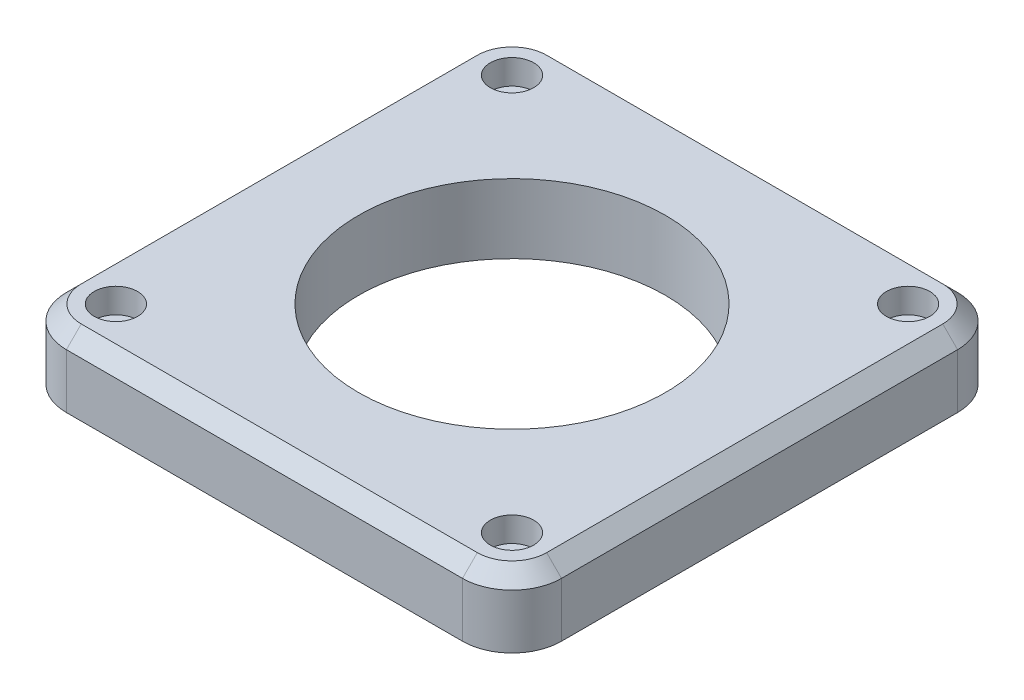
ISO-10303-21;
HEADER;
FILE_DESCRIPTION(('STEP AP214'),'2;1');
FILE_NAME('part.step','',(''),(''),'','','');
FILE_SCHEMA(('AUTOMOTIVE_DESIGN { 1 0 10303 214 1 1 1 1 }'));
ENDSEC;
DATA;
#1=APPLICATION_CONTEXT('core data for automotive mechanical design processes');
#2=APPLICATION_PROTOCOL_DEFINITION('international standard','automotive_design',2000,#1);
#3=PRODUCT_CONTEXT('',#1,'mechanical');
#4=PRODUCT('Part','Part','',(#3));
#5=PRODUCT_RELATED_PRODUCT_CATEGORY('part','',(#4));
#6=PRODUCT_DEFINITION_FORMATION('','',#4);
#7=PRODUCT_DEFINITION_CONTEXT('part definition',#1,'design');
#8=PRODUCT_DEFINITION('design','',#6,#7);
#9=PRODUCT_DEFINITION_SHAPE('','',#8);
#10=(LENGTH_UNIT() NAMED_UNIT(*) SI_UNIT(.MILLI.,.METRE.));
#11=(NAMED_UNIT(*) PLANE_ANGLE_UNIT() SI_UNIT($,.RADIAN.));
#12=(NAMED_UNIT(*) SI_UNIT($,.STERADIAN.) SOLID_ANGLE_UNIT());
#13=UNCERTAINTY_MEASURE_WITH_UNIT(LENGTH_MEASURE(1.E-05),#10,'distance_accuracy_value','');
#14=(GEOMETRIC_REPRESENTATION_CONTEXT(3) GLOBAL_UNCERTAINTY_ASSIGNED_CONTEXT((#13)) GLOBAL_UNIT_ASSIGNED_CONTEXT((#10,
#11,#12)) REPRESENTATION_CONTEXT('',''));
#15=CARTESIAN_POINT('',(0.,0.,0.));
#16=DIRECTION('',(0.,0.,1.));
#17=DIRECTION('',(1.,0.,0.));
#18=AXIS2_PLACEMENT_3D('',#15,#16,#17);
#19=CARTESIAN_POINT('',(-40.,14.,47.));
#20=DIRECTION('',(0.,-0.707106781186548,-0.707106781186547));
#21=DIRECTION('',(1.,0.,0.));
#22=AXIS2_PLACEMENT_3D('',#19,#20,#21);
#23=PLANE('',#22);
#24=DIRECTION('',(0.,-0.707106781186547,0.707106781186548));
#25=VECTOR('',#24,1.);
#26=CARTESIAN_POINT('',(39.9999999999999,14.,47.));
#27=LINE('',#26,#25);
#28=CARTESIAN_POINT('',(39.9999999999999,14.,47.));
#29=VERTEX_POINT('',#28);
#30=CARTESIAN_POINT('',(39.9999999999999,11.,50.));
#31=VERTEX_POINT('',#30);
#32=EDGE_CURVE('E13',#29,#31,#27,.T.);
#33=ORIENTED_EDGE('',*,*,#32,.F.);
#34=DIRECTION('',(1.,0.,0.));
#35=VECTOR('',#34,1.);
#36=CARTESIAN_POINT('',(-40.,14.,47.));
#37=LINE('',#36,#35);
#38=CARTESIAN_POINT('',(-39.9999999999999,14.,47.));
#39=VERTEX_POINT('',#38);
#40=EDGE_CURVE('E137',#39,#29,#37,.T.);
#41=ORIENTED_EDGE('',*,*,#40,.F.);
#42=DIRECTION('',(0.,-0.707106781186547,0.707106781186548));
#43=VECTOR('',#42,1.);
#44=CARTESIAN_POINT('',(-39.9999999999999,14.,47.));
#45=LINE('',#44,#43);
#46=CARTESIAN_POINT('',(-39.9999999999999,11.,50.));
#47=VERTEX_POINT('',#46);
#48=EDGE_CURVE('E47',#39,#47,#45,.T.);
#49=ORIENTED_EDGE('',*,*,#48,.T.);
#50=DIRECTION('',(-1.,0.,0.));
#51=VECTOR('',#50,1.);
#52=CARTESIAN_POINT('',(-39.9999999999999,11.,50.));
#53=LINE('',#52,#51);
#54=EDGE_CURVE('E134',#31,#47,#53,.T.);
#55=ORIENTED_EDGE('',*,*,#54,.F.);
#56=EDGE_LOOP('',(#33,#41,#49,#55));
#57=FACE_BOUND('',#56,.T.);
#58=ADVANCED_FACE('F39',(#57),#23,.F.);
#59=CARTESIAN_POINT('',(-40.,14.,40.));
#60=DIRECTION('',(0.,-1.,0.));
#61=DIRECTION('',(0.,0.,-1.));
#62=AXIS2_PLACEMENT_3D('',#59,#60,#61);
#63=CONICAL_SURFACE('',#62,7.,0.785398163397449);
#64=ORIENTED_EDGE('',*,*,#48,.F.);
#65=CARTESIAN_POINT('',(-40.,14.,40.));
#66=DIRECTION('',(0.,-1.,0.));
#67=DIRECTION('',(0.,0.,-1.));
#68=AXIS2_PLACEMENT_3D('',#65,#66,#67);
#69=CIRCLE('',#68,7.);
#70=CARTESIAN_POINT('',(-47.,14.,40.));
#71=VERTEX_POINT('',#70);
#72=EDGE_CURVE('E204',#71,#39,#69,.F.);
#73=ORIENTED_EDGE('',*,*,#72,.F.);
#74=DIRECTION('',(-0.707106781186548,-0.707106781186547,0.));
#75=VECTOR('',#74,1.);
#76=CARTESIAN_POINT('',(-47.,14.,39.9999999999999));
#77=LINE('',#76,#75);
#78=CARTESIAN_POINT('',(-50.,11.,39.9999999999999));
#79=VERTEX_POINT('',#78);
#80=EDGE_CURVE('E61',#71,#79,#77,.T.);
#81=ORIENTED_EDGE('',*,*,#80,.T.);
#82=CARTESIAN_POINT('',(-40.,11.,40.));
#83=DIRECTION('',(0.,-1.,0.));
#84=DIRECTION('',(0.,0.,-1.));
#85=AXIS2_PLACEMENT_3D('',#82,#83,#84);
#86=CIRCLE('',#85,10.);
#87=EDGE_CURVE('E243',#47,#79,#86,.T.);
#88=ORIENTED_EDGE('',*,*,#87,.F.);
#89=EDGE_LOOP('',(#64,#73,#81,#88));
#90=FACE_BOUND('',#89,.T.);
#91=ADVANCED_FACE('F292',(#90),#63,.T.);
#92=CARTESIAN_POINT('',(-47.,14.,40.));
#93=DIRECTION('',(0.707106781186547,-0.707106781186548,0.));
#94=DIRECTION('',(0.,0.,1.));
#95=AXIS2_PLACEMENT_3D('',#92,#93,#94);
#96=PLANE('',#95);
#97=ORIENTED_EDGE('',*,*,#80,.F.);
#98=DIRECTION('',(0.,0.,1.));
#99=VECTOR('',#98,1.);
#100=CARTESIAN_POINT('',(-47.,14.,40.));
#101=LINE('',#100,#99);
#102=CARTESIAN_POINT('',(-47.,14.,-39.9999999999999));
#103=VERTEX_POINT('',#102);
#104=EDGE_CURVE('E207',#103,#71,#101,.T.);
#105=ORIENTED_EDGE('',*,*,#104,.F.);
#106=DIRECTION('',(-0.707106781186548,-0.707106781186547,0.));
#107=VECTOR('',#106,1.);
#108=CARTESIAN_POINT('',(-47.,14.,-40.));
#109=LINE('',#108,#107);
#110=CARTESIAN_POINT('',(-50.,11.,-39.9999999999999));
#111=VERTEX_POINT('',#110);
#112=EDGE_CURVE('E254',#103,#111,#109,.T.);
#113=ORIENTED_EDGE('',*,*,#112,.T.);
#114=DIRECTION('',(0.,0.,-1.));
#115=VECTOR('',#114,1.);
#116=CARTESIAN_POINT('',(-50.,11.,39.9999999999999));
#117=LINE('',#116,#115);
#118=EDGE_CURVE('E240',#79,#111,#117,.T.);
#119=ORIENTED_EDGE('',*,*,#118,.F.);
#120=EDGE_LOOP('',(#97,#105,#113,#119));
#121=FACE_BOUND('',#120,.T.);
#122=ADVANCED_FACE('F259',(#121),#96,.F.);
#123=CARTESIAN_POINT('',(-40.,14.,-40.));
#124=DIRECTION('',(0.,-1.,0.));
#125=DIRECTION('',(0.,0.,-1.));
#126=AXIS2_PLACEMENT_3D('',#123,#124,#125);
#127=CONICAL_SURFACE('',#126,6.99999999999999,0.785398163397449);
#128=ORIENTED_EDGE('',*,*,#112,.F.);
#129=CARTESIAN_POINT('',(-40.,14.,-40.));
#130=DIRECTION('',(0.,-1.,0.));
#131=DIRECTION('',(0.,0.,-1.));
#132=AXIS2_PLACEMENT_3D('',#129,#130,#131);
#133=CIRCLE('',#132,6.99999999999999);
#134=CARTESIAN_POINT('',(-39.9999999999999,14.,-47.));
#135=VERTEX_POINT('',#134);
#136=EDGE_CURVE('E210',#135,#103,#133,.F.);
#137=ORIENTED_EDGE('',*,*,#136,.F.);
#138=DIRECTION('',(0.,-0.707106781186546,-0.707106781186549));
#139=VECTOR('',#138,1.);
#140=CARTESIAN_POINT('',(-39.9999999999999,14.,-47.));
#141=LINE('',#140,#139);
#142=CARTESIAN_POINT('',(-39.9999999999999,11.,-50.));
#143=VERTEX_POINT('',#142);
#144=EDGE_CURVE('E252',#135,#143,#141,.T.);
#145=ORIENTED_EDGE('',*,*,#144,.T.);
#146=CARTESIAN_POINT('',(-40.,11.,-40.));
#147=DIRECTION('',(0.,-1.,0.));
#148=DIRECTION('',(0.,0.,-1.));
#149=AXIS2_PLACEMENT_3D('',#146,#147,#148);
#150=CIRCLE('',#149,10.);
#151=EDGE_CURVE('E237',#111,#143,#150,.T.);
#152=ORIENTED_EDGE('',*,*,#151,.F.);
#153=EDGE_LOOP('',(#128,#137,#145,#152));
#154=FACE_BOUND('',#153,.T.);
#155=ADVANCED_FACE('F266',(#154),#127,.T.);
#156=CARTESIAN_POINT('',(-40.,14.,-47.));
#157=DIRECTION('',(0.,-0.707106781186549,0.707106781186546));
#158=DIRECTION('',(-1.,0.,0.));
#159=AXIS2_PLACEMENT_3D('',#156,#157,#158);
#160=PLANE('',#159);
#161=ORIENTED_EDGE('',*,*,#144,.F.);
#162=DIRECTION('',(-1.,0.,0.));
#163=VECTOR('',#162,1.);
#164=CARTESIAN_POINT('',(-40.,14.,-47.));
#165=LINE('',#164,#163);
#166=CARTESIAN_POINT('',(39.9999999999999,14.,-47.));
#167=VERTEX_POINT('',#166);
#168=EDGE_CURVE('E213',#167,#135,#165,.T.);
#169=ORIENTED_EDGE('',*,*,#168,.F.);
#170=DIRECTION('',(0.,-0.707106781186547,-0.707106781186548));
#171=VECTOR('',#170,1.);
#172=CARTESIAN_POINT('',(39.9999999999999,14.,-47.));
#173=LINE('',#172,#171);
#174=CARTESIAN_POINT('',(39.9999999999999,11.,-50.));
#175=VERTEX_POINT('',#174);
#176=EDGE_CURVE('E250',#167,#175,#173,.T.);
#177=ORIENTED_EDGE('',*,*,#176,.T.);
#178=DIRECTION('',(1.,0.,0.));
#179=VECTOR('',#178,1.);
#180=CARTESIAN_POINT('',(-39.9999999999999,11.,-50.));
#181=LINE('',#180,#179);
#182=EDGE_CURVE('E234',#143,#175,#181,.T.);
#183=ORIENTED_EDGE('',*,*,#182,.F.);
#184=EDGE_LOOP('',(#161,#169,#177,#183));
#185=FACE_BOUND('',#184,.T.);
#186=ADVANCED_FACE('F314',(#185),#160,.F.);
#187=CARTESIAN_POINT('',(40.,14.,-40.));
#188=DIRECTION('',(0.,-1.,0.));
#189=DIRECTION('',(0.,0.,-1.));
#190=AXIS2_PLACEMENT_3D('',#187,#188,#189);
#191=CONICAL_SURFACE('',#190,7.,0.785398163397449);
#192=ORIENTED_EDGE('',*,*,#176,.F.);
#193=CARTESIAN_POINT('',(40.,14.,-40.));
#194=DIRECTION('',(0.,-1.,0.));
#195=DIRECTION('',(0.,0.,-1.));
#196=AXIS2_PLACEMENT_3D('',#193,#194,#195);
#197=CIRCLE('',#196,7.);
#198=CARTESIAN_POINT('',(47.,14.,-40.));
#199=VERTEX_POINT('',#198);
#200=EDGE_CURVE('E216',#199,#167,#197,.F.);
#201=ORIENTED_EDGE('',*,*,#200,.F.);
#202=DIRECTION('',(0.707106781186547,-0.707106781186548,0.));
#203=VECTOR('',#202,1.);
#204=CARTESIAN_POINT('',(47.,14.,-39.9999999999999));
#205=LINE('',#204,#203);
#206=CARTESIAN_POINT('',(50.,11.,-39.9999999999999));
#207=VERTEX_POINT('',#206);
#208=EDGE_CURVE('E248',#199,#207,#205,.T.);
#209=ORIENTED_EDGE('',*,*,#208,.T.);
#210=CARTESIAN_POINT('',(40.,11.,-40.));
#211=DIRECTION('',(0.,-1.,0.));
#212=DIRECTION('',(0.,0.,-1.));
#213=AXIS2_PLACEMENT_3D('',#210,#211,#212);
#214=CIRCLE('',#213,10.);
#215=EDGE_CURVE('E231',#175,#207,#214,.T.);
#216=ORIENTED_EDGE('',*,*,#215,.F.);
#217=EDGE_LOOP('',(#192,#201,#209,#216));
#218=FACE_BOUND('',#217,.T.);
#219=ADVANCED_FACE('F320',(#218),#191,.T.);
#220=CARTESIAN_POINT('',(47.,14.,40.));
#221=DIRECTION('',(-0.707106781186548,-0.707106781186547,0.));
#222=DIRECTION('',(0.,0.,-1.));
#223=AXIS2_PLACEMENT_3D('',#220,#221,#222);
#224=PLANE('',#223);
#225=ORIENTED_EDGE('',*,*,#208,.F.);
#226=DIRECTION('',(0.,0.,-1.));
#227=VECTOR('',#226,1.);
#228=CARTESIAN_POINT('',(47.,14.,40.));
#229=LINE('',#228,#227);
#230=CARTESIAN_POINT('',(47.,14.,39.9999999999999));
#231=VERTEX_POINT('',#230);
#232=EDGE_CURVE('E219',#231,#199,#229,.T.);
#233=ORIENTED_EDGE('',*,*,#232,.F.);
#234=DIRECTION('',(0.707106781186548,-0.707106781186547,0.));
#235=VECTOR('',#234,1.);
#236=CARTESIAN_POINT('',(47.,14.,40.));
#237=LINE('',#236,#235);
#238=CARTESIAN_POINT('',(50.,11.,39.9999999999999));
#239=VERTEX_POINT('',#238);
#240=EDGE_CURVE('E246',#231,#239,#237,.T.);
#241=ORIENTED_EDGE('',*,*,#240,.T.);
#242=DIRECTION('',(0.,0.,1.));
#243=VECTOR('',#242,1.);
#244=CARTESIAN_POINT('',(50.,11.,39.9999999999999));
#245=LINE('',#244,#243);
#246=EDGE_CURVE('E228',#207,#239,#245,.T.);
#247=ORIENTED_EDGE('',*,*,#246,.F.);
#248=EDGE_LOOP('',(#225,#233,#241,#247));
#249=FACE_BOUND('',#248,.T.);
#250=ADVANCED_FACE('F327',(#249),#224,.F.);
#251=CARTESIAN_POINT('',(40.,14.,40.));
#252=DIRECTION('',(0.,-1.,0.));
#253=DIRECTION('',(0.,0.,-1.));
#254=AXIS2_PLACEMENT_3D('',#251,#252,#253);
#255=CONICAL_SURFACE('',#254,6.99999999999999,0.785398163397449);
#256=CARTESIAN_POINT('',(40.,14.,40.));
#257=DIRECTION('',(0.,-1.,0.));
#258=DIRECTION('',(0.,0.,-1.));
#259=AXIS2_PLACEMENT_3D('',#256,#257,#258);
#260=CIRCLE('',#259,6.99999999999999);
#261=EDGE_CURVE('E222',#29,#231,#260,.F.);
#262=ORIENTED_EDGE('',*,*,#261,.F.);
#263=ORIENTED_EDGE('',*,*,#32,.T.);
#264=CARTESIAN_POINT('',(40.,11.,40.));
#265=DIRECTION('',(0.,-1.,0.));
#266=DIRECTION('',(0.,0.,-1.));
#267=AXIS2_PLACEMENT_3D('',#264,#265,#266);
#268=CIRCLE('',#267,10.);
#269=EDGE_CURVE('E225',#239,#31,#268,.T.);
#270=ORIENTED_EDGE('',*,*,#269,.F.);
#271=ORIENTED_EDGE('',*,*,#240,.F.);
#272=EDGE_LOOP('',(#262,#263,#270,#271));
#273=FACE_BOUND('',#272,.T.);
#274=ADVANCED_FACE('F290',(#273),#255,.T.);
#275=CARTESIAN_POINT('',(-40.,14.,40.));
#276=DIRECTION('',(0.,-1.,0.));
#277=DIRECTION('',(0.,0.,-1.));
#278=AXIS2_PLACEMENT_3D('',#275,#276,#277);
#279=CYLINDRICAL_SURFACE('',#278,2.625);
#280=CARTESIAN_POINT('',(-40.,0.,40.));
#281=DIRECTION('',(0.,1.,0.));
#282=DIRECTION('',(0.,0.,1.));
#283=AXIS2_PLACEMENT_3D('',#280,#281,#282);
#284=CIRCLE('',#283,2.625);
#285=CARTESIAN_POINT('',(-40.,0.,42.625));
#286=VERTEX_POINT('',#285);
#287=EDGE_CURVE('E449',#286,#286,#284,.T.);
#288=ORIENTED_EDGE('',*,*,#287,.F.);
#289=EDGE_LOOP('',(#288));
#290=FACE_BOUND('',#289,.T.);
#291=CARTESIAN_POINT('',(-40.,9.,40.));
#292=DIRECTION('',(0.,1.,0.));
#293=DIRECTION('',(0.,0.,1.));
#294=AXIS2_PLACEMENT_3D('',#291,#292,#293);
#295=CIRCLE('',#294,2.625);
#296=CARTESIAN_POINT('',(-40.,9.,42.625));
#297=VERTEX_POINT('',#296);
#298=EDGE_CURVE('E198',#297,#297,#295,.T.);
#299=ORIENTED_EDGE('',*,*,#298,.T.);
#300=EDGE_LOOP('',(#299));
#301=FACE_BOUND('',#300,.T.);
#302=ADVANCED_FACE('F339',(#290,#301),#279,.F.);
#303=CARTESIAN_POINT('',(40.,14.,40.));
#304=DIRECTION('',(0.,-1.,0.));
#305=DIRECTION('',(0.,0.,-1.));
#306=AXIS2_PLACEMENT_3D('',#303,#304,#305);
#307=CYLINDRICAL_SURFACE('',#306,2.625);
#308=CARTESIAN_POINT('',(40.,0.,40.));
#309=DIRECTION('',(0.,1.,0.));
#310=DIRECTION('',(0.,0.,1.));
#311=AXIS2_PLACEMENT_3D('',#308,#309,#310);
#312=CIRCLE('',#311,2.625);
#313=CARTESIAN_POINT('',(40.,0.,42.625));
#314=VERTEX_POINT('',#313);
#315=EDGE_CURVE('E446',#314,#314,#312,.T.);
#316=ORIENTED_EDGE('',*,*,#315,.F.);
#317=EDGE_LOOP('',(#316));
#318=FACE_BOUND('',#317,.T.);
#319=CARTESIAN_POINT('',(40.,9.,40.));
#320=DIRECTION('',(0.,1.,0.));
#321=DIRECTION('',(0.,0.,1.));
#322=AXIS2_PLACEMENT_3D('',#319,#320,#321);
#323=CIRCLE('',#322,2.625);
#324=CARTESIAN_POINT('',(40.,9.,42.625));
#325=VERTEX_POINT('',#324);
#326=EDGE_CURVE('E195',#325,#325,#323,.T.);
#327=ORIENTED_EDGE('',*,*,#326,.T.);
#328=EDGE_LOOP('',(#327));
#329=FACE_BOUND('',#328,.T.);
#330=ADVANCED_FACE('F371',(#318,#329),#307,.F.);
#331=CARTESIAN_POINT('',(40.,14.,-40.));
#332=DIRECTION('',(0.,-1.,0.));
#333=DIRECTION('',(0.,0.,-1.));
#334=AXIS2_PLACEMENT_3D('',#331,#332,#333);
#335=CYLINDRICAL_SURFACE('',#334,2.625);
#336=CARTESIAN_POINT('',(40.,0.,-40.));
#337=DIRECTION('',(0.,1.,0.));
#338=DIRECTION('',(0.,0.,1.));
#339=AXIS2_PLACEMENT_3D('',#336,#337,#338);
#340=CIRCLE('',#339,2.625);
#341=CARTESIAN_POINT('',(40.,0.,-37.375));
#342=VERTEX_POINT('',#341);
#343=EDGE_CURVE('E443',#342,#342,#340,.T.);
#344=ORIENTED_EDGE('',*,*,#343,.F.);
#345=EDGE_LOOP('',(#344));
#346=FACE_BOUND('',#345,.T.);
#347=CARTESIAN_POINT('',(40.,9.,-40.));
#348=DIRECTION('',(0.,1.,0.));
#349=DIRECTION('',(0.,0.,1.));
#350=AXIS2_PLACEMENT_3D('',#347,#348,#349);
#351=CIRCLE('',#350,2.625);
#352=CARTESIAN_POINT('',(40.,9.,-37.375));
#353=VERTEX_POINT('',#352);
#354=EDGE_CURVE('E191',#353,#353,#351,.T.);
#355=ORIENTED_EDGE('',*,*,#354,.T.);
#356=EDGE_LOOP('',(#355));
#357=FACE_BOUND('',#356,.T.);
#358=ADVANCED_FACE('F375',(#346,#357),#335,.F.);
#359=CARTESIAN_POINT('',(-40.,14.,-40.));
#360=DIRECTION('',(0.,-1.,0.));
#361=DIRECTION('',(0.,0.,-1.));
#362=AXIS2_PLACEMENT_3D('',#359,#360,#361);
#363=CYLINDRICAL_SURFACE('',#362,2.625);
#364=CARTESIAN_POINT('',(-40.,0.,-40.));
#365=DIRECTION('',(0.,1.,0.));
#366=DIRECTION('',(0.,0.,1.));
#367=AXIS2_PLACEMENT_3D('',#364,#365,#366);
#368=CIRCLE('',#367,2.625);
#369=CARTESIAN_POINT('',(-40.,0.,-37.375));
#370=VERTEX_POINT('',#369);
#371=EDGE_CURVE('E201',#370,#370,#368,.T.);
#372=ORIENTED_EDGE('',*,*,#371,.F.);
#373=EDGE_LOOP('',(#372));
#374=FACE_BOUND('',#373,.T.);
#375=CARTESIAN_POINT('',(-40.,9.,-40.));
#376=DIRECTION('',(0.,1.,0.));
#377=DIRECTION('',(0.,0.,1.));
#378=AXIS2_PLACEMENT_3D('',#375,#376,#377);
#379=CIRCLE('',#378,2.625);
#380=CARTESIAN_POINT('',(-40.,9.,-37.375));
#381=VERTEX_POINT('',#380);
#382=EDGE_CURVE('E188',#381,#381,#379,.T.);
#383=ORIENTED_EDGE('',*,*,#382,.T.);
#384=EDGE_LOOP('',(#383));
#385=FACE_BOUND('',#384,.T.);
#386=ADVANCED_FACE('F363',(#374,#385),#363,.F.);
#387=CARTESIAN_POINT('',(-40.,14.,40.));
#388=DIRECTION('',(0.,-1.,0.));
#389=DIRECTION('',(0.,0.,-1.));
#390=AXIS2_PLACEMENT_3D('',#387,#388,#389);
#391=PLANE('',#390);
#392=ORIENTED_EDGE('',*,*,#40,.T.);
#393=ORIENTED_EDGE('',*,*,#261,.T.);
#394=ORIENTED_EDGE('',*,*,#232,.T.);
#395=ORIENTED_EDGE('',*,*,#200,.T.);
#396=ORIENTED_EDGE('',*,*,#168,.T.);
#397=ORIENTED_EDGE('',*,*,#136,.T.);
#398=ORIENTED_EDGE('',*,*,#104,.T.);
#399=ORIENTED_EDGE('',*,*,#72,.T.);
#400=EDGE_LOOP('',(#392,#393,#394,#395,#396,#397,#398,#399));
#401=FACE_BOUND('',#400,.T.);
#402=CARTESIAN_POINT('',(-40.,14.,40.));
#403=DIRECTION('',(0.,1.,0.));
#404=DIRECTION('',(0.,0.,1.));
#405=AXIS2_PLACEMENT_3D('',#402,#403,#404);
#406=CIRCLE('',#405,4.37500000000001);
#407=CARTESIAN_POINT('',(-40.,14.,44.375));
#408=VERTEX_POINT('',#407);
#409=EDGE_CURVE('E436',#408,#408,#406,.T.);
#410=ORIENTED_EDGE('',*,*,#409,.F.);
#411=EDGE_LOOP('',(#410));
#412=FACE_BOUND('',#411,.T.);
#413=CARTESIAN_POINT('',(40.,14.,40.));
#414=DIRECTION('',(0.,1.,0.));
#415=DIRECTION('',(0.,0.,1.));
#416=AXIS2_PLACEMENT_3D('',#413,#414,#415);
#417=CIRCLE('',#416,4.37500000000001);
#418=CARTESIAN_POINT('',(40.,14.,44.375));
#419=VERTEX_POINT('',#418);
#420=EDGE_CURVE('E430',#419,#419,#417,.T.);
#421=ORIENTED_EDGE('',*,*,#420,.F.);
#422=EDGE_LOOP('',(#421));
#423=FACE_BOUND('',#422,.T.);
#424=CARTESIAN_POINT('',(40.,14.,-40.));
#425=DIRECTION('',(0.,1.,0.));
#426=DIRECTION('',(0.,0.,1.));
#427=AXIS2_PLACEMENT_3D('',#424,#425,#426);
#428=CIRCLE('',#427,4.37500000000001);
#429=CARTESIAN_POINT('',(40.,14.,-35.625));
#430=VERTEX_POINT('',#429);
#431=EDGE_CURVE('E420',#430,#430,#428,.T.);
#432=ORIENTED_EDGE('',*,*,#431,.F.);
#433=EDGE_LOOP('',(#432));
#434=FACE_BOUND('',#433,.T.);
#435=CARTESIAN_POINT('',(-40.,14.,-40.));
#436=DIRECTION('',(0.,1.,0.));
#437=DIRECTION('',(0.,0.,1.));
#438=AXIS2_PLACEMENT_3D('',#435,#436,#437);
#439=CIRCLE('',#438,4.37500000000001);
#440=CARTESIAN_POINT('',(-40.,14.,-35.625));
#441=VERTEX_POINT('',#440);
#442=EDGE_CURVE('E419',#441,#441,#439,.T.);
#443=ORIENTED_EDGE('',*,*,#442,.F.);
#444=EDGE_LOOP('',(#443));
#445=FACE_BOUND('',#444,.T.);
#446=CARTESIAN_POINT('',(0.,14.,0.));
#447=DIRECTION('',(0.,1.,0.));
#448=DIRECTION('',(0.,0.,1.));
#449=AXIS2_PLACEMENT_3D('',#446,#447,#448);
#450=CIRCLE('',#449,31.);
#451=CARTESIAN_POINT('',(0.,14.,31.));
#452=VERTEX_POINT('',#451);
#453=EDGE_CURVE('E154',#452,#452,#450,.T.);
#454=ORIENTED_EDGE('',*,*,#453,.F.);
#455=EDGE_LOOP('',(#454));
#456=FACE_BOUND('',#455,.T.);
#457=ADVANCED_FACE('F359',(#401,#412,#423,#434,#445,#456),#391,.F.);
#458=CARTESIAN_POINT('',(-40.,0.,40.));
#459=DIRECTION('',(0.,-1.,0.));
#460=DIRECTION('',(0.,0.,-1.));
#461=AXIS2_PLACEMENT_3D('',#458,#459,#460);
#462=PLANE('',#461);
#463=ORIENTED_EDGE('',*,*,#343,.T.);
#464=EDGE_LOOP('',(#463));
#465=FACE_BOUND('',#464,.T.);
#466=ORIENTED_EDGE('',*,*,#287,.T.);
#467=EDGE_LOOP('',(#466));
#468=FACE_BOUND('',#467,.T.);
#469=CARTESIAN_POINT('',(-40.,0.,40.));
#470=DIRECTION('',(0.,1.,0.));
#471=DIRECTION('',(0.,0.,-1.));
#472=AXIS2_PLACEMENT_3D('',#469,#470,#471);
#473=CIRCLE('',#472,10.);
#474=CARTESIAN_POINT('',(-50.,0.,39.9999999999999));
#475=VERTEX_POINT('',#474);
#476=CARTESIAN_POINT('',(-39.9999999999999,0.,50.));
#477=VERTEX_POINT('',#476);
#478=EDGE_CURVE('E145',#475,#477,#473,.T.);
#479=ORIENTED_EDGE('',*,*,#478,.F.);
#480=DIRECTION('',(0.,0.,1.));
#481=VECTOR('',#480,1.);
#482=CARTESIAN_POINT('',(-50.,0.,39.9999999999999));
#483=LINE('',#482,#481);
#484=CARTESIAN_POINT('',(-50.,0.,-39.9999999999999));
#485=VERTEX_POINT('',#484);
#486=EDGE_CURVE('E174',#485,#475,#483,.T.);
#487=ORIENTED_EDGE('',*,*,#486,.F.);
#488=CARTESIAN_POINT('',(-40.,0.,-40.));
#489=DIRECTION('',(0.,1.,0.));
#490=DIRECTION('',(0.,0.,-1.));
#491=AXIS2_PLACEMENT_3D('',#488,#489,#490);
#492=CIRCLE('',#491,10.);
#493=CARTESIAN_POINT('',(-39.9999999999999,0.,-50.));
#494=VERTEX_POINT('',#493);
#495=EDGE_CURVE('E171',#494,#485,#492,.T.);
#496=ORIENTED_EDGE('',*,*,#495,.F.);
#497=DIRECTION('',(-1.,0.,0.));
#498=VECTOR('',#497,1.);
#499=CARTESIAN_POINT('',(-39.9999999999999,0.,-50.));
#500=LINE('',#499,#498);
#501=CARTESIAN_POINT('',(39.9999999999999,0.,-50.));
#502=VERTEX_POINT('',#501);
#503=EDGE_CURVE('E168',#502,#494,#500,.T.);
#504=ORIENTED_EDGE('',*,*,#503,.F.);
#505=CARTESIAN_POINT('',(40.,0.,-40.));
#506=DIRECTION('',(0.,1.,0.));
#507=DIRECTION('',(0.,0.,-1.));
#508=AXIS2_PLACEMENT_3D('',#505,#506,#507);
#509=CIRCLE('',#508,10.);
#510=CARTESIAN_POINT('',(50.,0.,-39.9999999999999));
#511=VERTEX_POINT('',#510);
#512=EDGE_CURVE('E165',#511,#502,#509,.T.);
#513=ORIENTED_EDGE('',*,*,#512,.F.);
#514=DIRECTION('',(0.,0.,-1.));
#515=VECTOR('',#514,1.);
#516=CARTESIAN_POINT('',(50.,0.,39.9999999999999));
#517=LINE('',#516,#515);
#518=CARTESIAN_POINT('',(50.,0.,39.9999999999999));
#519=VERTEX_POINT('',#518);
#520=EDGE_CURVE('E162',#519,#511,#517,.T.);
#521=ORIENTED_EDGE('',*,*,#520,.F.);
#522=CARTESIAN_POINT('',(40.,0.,40.));
#523=DIRECTION('',(0.,1.,0.));
#524=DIRECTION('',(0.,0.,1.));
#525=AXIS2_PLACEMENT_3D('',#522,#523,#524);
#526=CIRCLE('',#525,10.);
#527=CARTESIAN_POINT('',(39.9999999999999,0.,50.));
#528=VERTEX_POINT('',#527);
#529=EDGE_CURVE('E148',#528,#519,#526,.T.);
#530=ORIENTED_EDGE('',*,*,#529,.F.);
#531=DIRECTION('',(1.,0.,0.));
#532=VECTOR('',#531,1.);
#533=CARTESIAN_POINT('',(-39.9999999999999,0.,50.));
#534=LINE('',#533,#532);
#535=EDGE_CURVE('E132',#477,#528,#534,.T.);
#536=ORIENTED_EDGE('',*,*,#535,.F.);
#537=EDGE_LOOP('',(#479,#487,#496,#504,#513,#521,#530,#536));
#538=FACE_BOUND('',#537,.T.);
#539=CARTESIAN_POINT('',(0.,0.,0.));
#540=DIRECTION('',(0.,1.,0.));
#541=DIRECTION('',(0.,0.,1.));
#542=AXIS2_PLACEMENT_3D('',#539,#540,#541);
#543=CIRCLE('',#542,31.);
#544=CARTESIAN_POINT('',(0.,0.,31.));
#545=VERTEX_POINT('',#544);
#546=EDGE_CURVE('E157',#545,#545,#543,.T.);
#547=ORIENTED_EDGE('',*,*,#546,.T.);
#548=EDGE_LOOP('',(#547));
#549=FACE_BOUND('',#548,.T.);
#550=ORIENTED_EDGE('',*,*,#315,.T.);
#551=EDGE_LOOP('',(#550));
#552=FACE_BOUND('',#551,.T.);
#553=ORIENTED_EDGE('',*,*,#371,.T.);
#554=EDGE_LOOP('',(#553));
#555=FACE_BOUND('',#554,.T.);
#556=ADVANCED_FACE('F142',(#465,#468,#538,#549,#552,#555),#462,.T.);
#557=CARTESIAN_POINT('',(-40.,14.,40.));
#558=DIRECTION('',(0.,-1.,0.));
#559=DIRECTION('',(0.,0.,-1.));
#560=AXIS2_PLACEMENT_3D('',#557,#558,#559);
#561=CYLINDRICAL_SURFACE('',#560,10.);
#562=DIRECTION('',(0.,-1.,0.));
#563=VECTOR('',#562,1.);
#564=CARTESIAN_POINT('',(-39.9999999999999,14.,50.));
#565=LINE('',#564,#563);
#566=EDGE_CURVE('E128',#47,#477,#565,.T.);
#567=ORIENTED_EDGE('',*,*,#566,.F.);
#568=ORIENTED_EDGE('',*,*,#87,.T.);
#569=DIRECTION('',(0.,-1.,0.));
#570=VECTOR('',#569,1.);
#571=CARTESIAN_POINT('',(-50.,14.,39.9999999999999));
#572=LINE('',#571,#570);
#573=EDGE_CURVE('E152',#79,#475,#572,.T.);
#574=ORIENTED_EDGE('',*,*,#573,.T.);
#575=ORIENTED_EDGE('',*,*,#478,.T.);
#576=EDGE_LOOP('',(#567,#568,#574,#575));
#577=FACE_BOUND('',#576,.T.);
#578=ADVANCED_FACE('F150',(#577),#561,.T.);
#579=CARTESIAN_POINT('',(-39.9999999999999,14.,50.));
#580=DIRECTION('',(0.,0.,-1.));
#581=DIRECTION('',(-1.,0.,0.));
#582=AXIS2_PLACEMENT_3D('',#579,#580,#581);
#583=PLANE('',#582);
#584=DIRECTION('',(0.,-1.,0.));
#585=VECTOR('',#584,1.);
#586=CARTESIAN_POINT('',(39.9999999999999,14.,50.));
#587=LINE('',#586,#585);
#588=EDGE_CURVE('E138',#31,#528,#587,.T.);
#589=ORIENTED_EDGE('',*,*,#588,.F.);
#590=ORIENTED_EDGE('',*,*,#54,.T.);
#591=ORIENTED_EDGE('',*,*,#566,.T.);
#592=ORIENTED_EDGE('',*,*,#535,.T.);
#593=EDGE_LOOP('',(#589,#590,#591,#592));
#594=FACE_BOUND('',#593,.T.);
#595=ADVANCED_FACE('F131',(#594),#583,.F.);
#596=CARTESIAN_POINT('',(40.,14.,40.));
#597=DIRECTION('',(0.,-1.,0.));
#598=DIRECTION('',(0.,0.,-1.));
#599=AXIS2_PLACEMENT_3D('',#596,#597,#598);
#600=CYLINDRICAL_SURFACE('',#599,10.);
#601=DIRECTION('',(0.,-1.,0.));
#602=VECTOR('',#601,1.);
#603=CARTESIAN_POINT('',(50.,14.,39.9999999999999));
#604=LINE('',#603,#602);
#605=EDGE_CURVE('E185',#239,#519,#604,.T.);
#606=ORIENTED_EDGE('',*,*,#605,.F.);
#607=ORIENTED_EDGE('',*,*,#269,.T.);
#608=ORIENTED_EDGE('',*,*,#588,.T.);
#609=ORIENTED_EDGE('',*,*,#529,.T.);
#610=EDGE_LOOP('',(#606,#607,#608,#609));
#611=FACE_BOUND('',#610,.T.);
#612=ADVANCED_FACE('F287',(#611),#600,.T.);
#613=CARTESIAN_POINT('',(50.,14.,39.9999999999999));
#614=DIRECTION('',(-1.,0.,0.));
#615=DIRECTION('',(0.,0.,1.));
#616=AXIS2_PLACEMENT_3D('',#613,#614,#615);
#617=PLANE('',#616);
#618=DIRECTION('',(0.,-1.,0.));
#619=VECTOR('',#618,1.);
#620=CARTESIAN_POINT('',(50.,14.,-39.9999999999999));
#621=LINE('',#620,#619);
#622=EDGE_CURVE('E183',#207,#511,#621,.T.);
#623=ORIENTED_EDGE('',*,*,#622,.F.);
#624=ORIENTED_EDGE('',*,*,#246,.T.);
#625=ORIENTED_EDGE('',*,*,#605,.T.);
#626=ORIENTED_EDGE('',*,*,#520,.T.);
#627=EDGE_LOOP('',(#623,#624,#625,#626));
#628=FACE_BOUND('',#627,.T.);
#629=ADVANCED_FACE('F283',(#628),#617,.F.);
#630=CARTESIAN_POINT('',(40.,14.,-40.));
#631=DIRECTION('',(0.,-1.,0.));
#632=DIRECTION('',(0.,0.,-1.));
#633=AXIS2_PLACEMENT_3D('',#630,#631,#632);
#634=CYLINDRICAL_SURFACE('',#633,10.);
#635=DIRECTION('',(0.,-1.,0.));
#636=VECTOR('',#635,1.);
#637=CARTESIAN_POINT('',(39.9999999999999,14.,-50.));
#638=LINE('',#637,#636);
#639=EDGE_CURVE('E181',#175,#502,#638,.T.);
#640=ORIENTED_EDGE('',*,*,#639,.F.);
#641=ORIENTED_EDGE('',*,*,#215,.T.);
#642=ORIENTED_EDGE('',*,*,#622,.T.);
#643=ORIENTED_EDGE('',*,*,#512,.T.);
#644=EDGE_LOOP('',(#640,#641,#642,#643));
#645=FACE_BOUND('',#644,.T.);
#646=ADVANCED_FACE('F279',(#645),#634,.T.);
#647=CARTESIAN_POINT('',(-39.9999999999999,14.,-50.));
#648=DIRECTION('',(0.,0.,1.));
#649=DIRECTION('',(1.,0.,0.));
#650=AXIS2_PLACEMENT_3D('',#647,#648,#649);
#651=PLANE('',#650);
#652=DIRECTION('',(0.,-1.,0.));
#653=VECTOR('',#652,1.);
#654=CARTESIAN_POINT('',(-39.9999999999999,14.,-50.));
#655=LINE('',#654,#653);
#656=EDGE_CURVE('E179',#143,#494,#655,.T.);
#657=ORIENTED_EDGE('',*,*,#656,.F.);
#658=ORIENTED_EDGE('',*,*,#182,.T.);
#659=ORIENTED_EDGE('',*,*,#639,.T.);
#660=ORIENTED_EDGE('',*,*,#503,.T.);
#661=EDGE_LOOP('',(#657,#658,#659,#660));
#662=FACE_BOUND('',#661,.T.);
#663=ADVANCED_FACE('F275',(#662),#651,.F.);
#664=CARTESIAN_POINT('',(-40.,14.,-40.));
#665=DIRECTION('',(0.,-1.,0.));
#666=DIRECTION('',(0.,0.,-1.));
#667=AXIS2_PLACEMENT_3D('',#664,#665,#666);
#668=CYLINDRICAL_SURFACE('',#667,10.);
#669=DIRECTION('',(0.,-1.,0.));
#670=VECTOR('',#669,1.);
#671=CARTESIAN_POINT('',(-50.,14.,-39.9999999999999));
#672=LINE('',#671,#670);
#673=EDGE_CURVE('E177',#111,#485,#672,.T.);
#674=ORIENTED_EDGE('',*,*,#673,.F.);
#675=ORIENTED_EDGE('',*,*,#151,.T.);
#676=ORIENTED_EDGE('',*,*,#656,.T.);
#677=ORIENTED_EDGE('',*,*,#495,.T.);
#678=EDGE_LOOP('',(#674,#675,#676,#677));
#679=FACE_BOUND('',#678,.T.);
#680=ADVANCED_FACE('F269',(#679),#668,.T.);
#681=CARTESIAN_POINT('',(-50.,14.,39.9999999999999));
#682=DIRECTION('',(1.,0.,0.));
#683=DIRECTION('',(0.,0.,-1.));
#684=AXIS2_PLACEMENT_3D('',#681,#682,#683);
#685=PLANE('',#684);
#686=ORIENTED_EDGE('',*,*,#573,.F.);
#687=ORIENTED_EDGE('',*,*,#118,.T.);
#688=ORIENTED_EDGE('',*,*,#673,.T.);
#689=ORIENTED_EDGE('',*,*,#486,.T.);
#690=EDGE_LOOP('',(#686,#687,#688,#689));
#691=FACE_BOUND('',#690,.T.);
#692=ADVANCED_FACE('F264',(#691),#685,.F.);
#693=CARTESIAN_POINT('',(0.,14.,0.));
#694=DIRECTION('',(0.,-1.,0.));
#695=DIRECTION('',(0.,0.,-1.));
#696=AXIS2_PLACEMENT_3D('',#693,#694,#695);
#697=CYLINDRICAL_SURFACE('',#696,31.);
#698=ORIENTED_EDGE('',*,*,#453,.T.);
#699=EDGE_LOOP('',(#698));
#700=FACE_BOUND('',#699,.T.);
#701=ORIENTED_EDGE('',*,*,#546,.F.);
#702=EDGE_LOOP('',(#701));
#703=FACE_BOUND('',#702,.T.);
#704=ADVANCED_FACE('F356',(#700,#703),#697,.F.);
#705=CARTESIAN_POINT('',(-40.,9.,-40.));
#706=DIRECTION('',(0.,1.,0.));
#707=DIRECTION('',(0.,0.,1.));
#708=AXIS2_PLACEMENT_3D('',#705,#706,#707);
#709=CYLINDRICAL_SURFACE('',#708,4.37500000000001);
#710=CARTESIAN_POINT('',(-40.,9.,-40.));
#711=DIRECTION('',(0.,1.,0.));
#712=DIRECTION('',(0.,0.,1.));
#713=AXIS2_PLACEMENT_3D('',#710,#711,#712);
#714=CIRCLE('',#713,4.37500000000001);
#715=CARTESIAN_POINT('',(-40.,9.,-35.625));
#716=VERTEX_POINT('',#715);
#717=EDGE_CURVE('E192',#716,#716,#714,.T.);
#718=ORIENTED_EDGE('',*,*,#717,.F.);
#719=EDGE_LOOP('',(#718));
#720=FACE_BOUND('',#719,.T.);
#721=ORIENTED_EDGE('',*,*,#442,.T.);
#722=EDGE_LOOP('',(#721));
#723=FACE_BOUND('',#722,.T.);
#724=ADVANCED_FACE('F367',(#720,#723),#709,.F.);
#725=CARTESIAN_POINT('',(-40.,9.,-40.));
#726=DIRECTION('',(0.,1.,0.));
#727=DIRECTION('',(0.,0.,1.));
#728=AXIS2_PLACEMENT_3D('',#725,#726,#727);
#729=PLANE('',#728);
#730=ORIENTED_EDGE('',*,*,#382,.F.);
#731=EDGE_LOOP('',(#730));
#732=FACE_BOUND('',#731,.T.);
#733=ORIENTED_EDGE('',*,*,#717,.T.);
#734=EDGE_LOOP('',(#733));
#735=FACE_BOUND('',#734,.T.);
#736=ADVANCED_FACE('F385',(#732,#735),#729,.T.);
#737=CARTESIAN_POINT('',(40.,9.,-40.));
#738=DIRECTION('',(0.,1.,0.));
#739=DIRECTION('',(0.,0.,1.));
#740=AXIS2_PLACEMENT_3D('',#737,#738,#739);
#741=CYLINDRICAL_SURFACE('',#740,4.37500000000001);
#742=CARTESIAN_POINT('',(40.,9.,-40.));
#743=DIRECTION('',(0.,1.,0.));
#744=DIRECTION('',(0.,0.,1.));
#745=AXIS2_PLACEMENT_3D('',#742,#743,#744);
#746=CIRCLE('',#745,4.37500000000001);
#747=CARTESIAN_POINT('',(40.,9.,-35.625));
#748=VERTEX_POINT('',#747);
#749=EDGE_CURVE('E418',#748,#748,#746,.T.);
#750=ORIENTED_EDGE('',*,*,#749,.F.);
#751=EDGE_LOOP('',(#750));
#752=FACE_BOUND('',#751,.T.);
#753=ORIENTED_EDGE('',*,*,#431,.T.);
#754=EDGE_LOOP('',(#753));
#755=FACE_BOUND('',#754,.T.);
#756=ADVANCED_FACE('F389',(#752,#755),#741,.F.);
#757=CARTESIAN_POINT('',(40.,9.,-40.));
#758=DIRECTION('',(0.,1.,0.));
#759=DIRECTION('',(0.,0.,1.));
#760=AXIS2_PLACEMENT_3D('',#757,#758,#759);
#761=PLANE('',#760);
#762=ORIENTED_EDGE('',*,*,#354,.F.);
#763=EDGE_LOOP('',(#762));
#764=FACE_BOUND('',#763,.T.);
#765=ORIENTED_EDGE('',*,*,#749,.T.);
#766=EDGE_LOOP('',(#765));
#767=FACE_BOUND('',#766,.T.);
#768=ADVANCED_FACE('F402',(#764,#767),#761,.T.);
#769=CARTESIAN_POINT('',(40.,9.,40.));
#770=DIRECTION('',(0.,1.,0.));
#771=DIRECTION('',(0.,0.,1.));
#772=AXIS2_PLACEMENT_3D('',#769,#770,#771);
#773=CYLINDRICAL_SURFACE('',#772,4.37500000000001);
#774=CARTESIAN_POINT('',(40.,9.,40.));
#775=DIRECTION('',(0.,1.,0.));
#776=DIRECTION('',(0.,0.,1.));
#777=AXIS2_PLACEMENT_3D('',#774,#775,#776);
#778=CIRCLE('',#777,4.37500000000001);
#779=CARTESIAN_POINT('',(40.,9.,44.375));
#780=VERTEX_POINT('',#779);
#781=EDGE_CURVE('E425',#780,#780,#778,.T.);
#782=ORIENTED_EDGE('',*,*,#781,.F.);
#783=EDGE_LOOP('',(#782));
#784=FACE_BOUND('',#783,.T.);
#785=ORIENTED_EDGE('',*,*,#420,.T.);
#786=EDGE_LOOP('',(#785));
#787=FACE_BOUND('',#786,.T.);
#788=ADVANCED_FACE('F399',(#784,#787),#773,.F.);
#789=CARTESIAN_POINT('',(40.,9.,40.));
#790=DIRECTION('',(0.,1.,0.));
#791=DIRECTION('',(0.,0.,1.));
#792=AXIS2_PLACEMENT_3D('',#789,#790,#791);
#793=PLANE('',#792);
#794=ORIENTED_EDGE('',*,*,#326,.F.);
#795=EDGE_LOOP('',(#794));
#796=FACE_BOUND('',#795,.T.);
#797=ORIENTED_EDGE('',*,*,#781,.T.);
#798=EDGE_LOOP('',(#797));
#799=FACE_BOUND('',#798,.T.);
#800=ADVANCED_FACE('F395',(#796,#799),#793,.T.);
#801=CARTESIAN_POINT('',(-40.,9.,40.));
#802=DIRECTION('',(0.,1.,0.));
#803=DIRECTION('',(0.,0.,1.));
#804=AXIS2_PLACEMENT_3D('',#801,#802,#803);
#805=CYLINDRICAL_SURFACE('',#804,4.37500000000001);
#806=CARTESIAN_POINT('',(-40.,9.,40.));
#807=DIRECTION('',(0.,1.,0.));
#808=DIRECTION('',(0.,0.,1.));
#809=AXIS2_PLACEMENT_3D('',#806,#807,#808);
#810=CIRCLE('',#809,4.37500000000001);
#811=CARTESIAN_POINT('',(-40.,9.,44.375));
#812=VERTEX_POINT('',#811);
#813=EDGE_CURVE('E433',#812,#812,#810,.T.);
#814=ORIENTED_EDGE('',*,*,#813,.F.);
#815=EDGE_LOOP('',(#814));
#816=FACE_BOUND('',#815,.T.);
#817=ORIENTED_EDGE('',*,*,#409,.T.);
#818=EDGE_LOOP('',(#817));
#819=FACE_BOUND('',#818,.T.);
#820=ADVANCED_FACE('F391',(#816,#819),#805,.F.);
#821=CARTESIAN_POINT('',(-40.,9.,40.));
#822=DIRECTION('',(0.,1.,0.));
#823=DIRECTION('',(0.,0.,1.));
#824=AXIS2_PLACEMENT_3D('',#821,#822,#823);
#825=PLANE('',#824);
#826=ORIENTED_EDGE('',*,*,#298,.F.);
#827=EDGE_LOOP('',(#826));
#828=FACE_BOUND('',#827,.T.);
#829=ORIENTED_EDGE('',*,*,#813,.T.);
#830=EDGE_LOOP('',(#829));
#831=FACE_BOUND('',#830,.T.);
#832=ADVANCED_FACE('F394',(#828,#831),#825,.T.);
#833=CLOSED_SHELL('',(#58,#91,#122,#155,#186,#219,#250,#274,#302,#330,#358,#386,#457,#556,#578,
#595,#612,#629,#646,#663,#680,#692,#704,#724,#736,#756,#768,#788,#800,#820,#832));
#834=MANIFOLD_SOLID_BREP('B2',#833);
#835=ADVANCED_BREP_SHAPE_REPRESENTATION('',(#18,#834),#14);
#836=SHAPE_DEFINITION_REPRESENTATION(#9,#835);
ENDSEC;
END-ISO-10303-21;
